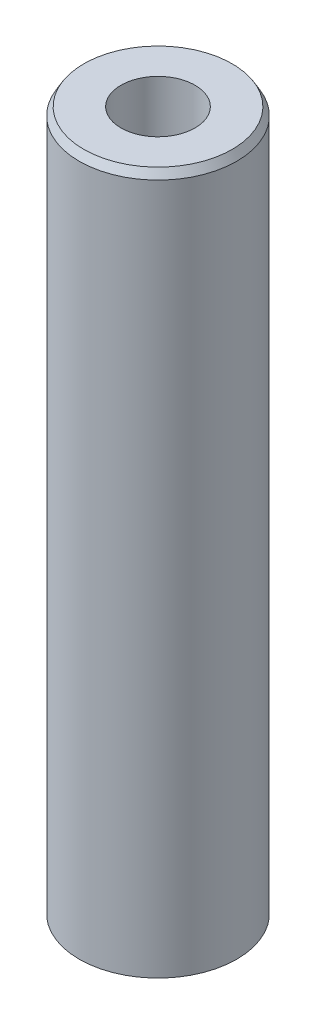
ISO-10303-21;
HEADER;
FILE_DESCRIPTION(('STEP AP214'),'2;1');
FILE_NAME('part.step','',(''),(''),'','','');
FILE_SCHEMA(('AUTOMOTIVE_DESIGN { 1 0 10303 214 1 1 1 1 }'));
ENDSEC;
DATA;
#1=APPLICATION_CONTEXT('core data for automotive mechanical design processes');
#2=APPLICATION_PROTOCOL_DEFINITION('international standard','automotive_design',2000,#1);
#3=PRODUCT_CONTEXT('',#1,'mechanical');
#4=PRODUCT('Part','Part','',(#3));
#5=PRODUCT_RELATED_PRODUCT_CATEGORY('part','',(#4));
#6=PRODUCT_DEFINITION_FORMATION('','',#4);
#7=PRODUCT_DEFINITION_CONTEXT('part definition',#1,'design');
#8=PRODUCT_DEFINITION('design','',#6,#7);
#9=PRODUCT_DEFINITION_SHAPE('','',#8);
#10=(LENGTH_UNIT() NAMED_UNIT(*) SI_UNIT(.MILLI.,.METRE.));
#11=(NAMED_UNIT(*) PLANE_ANGLE_UNIT() SI_UNIT($,.RADIAN.));
#12=(NAMED_UNIT(*) SI_UNIT($,.STERADIAN.) SOLID_ANGLE_UNIT());
#13=UNCERTAINTY_MEASURE_WITH_UNIT(LENGTH_MEASURE(1.E-05),#10,'distance_accuracy_value','');
#14=(GEOMETRIC_REPRESENTATION_CONTEXT(3) GLOBAL_UNCERTAINTY_ASSIGNED_CONTEXT((#13)) GLOBAL_UNIT_ASSIGNED_CONTEXT((#10,
#11,#12)) REPRESENTATION_CONTEXT('',''));
#15=CARTESIAN_POINT('',(0.,0.,0.));
#16=DIRECTION('',(0.,0.,1.));
#17=DIRECTION('',(1.,0.,0.));
#18=AXIS2_PLACEMENT_3D('',#15,#16,#17);
#19=CARTESIAN_POINT('',(0.,245.557551608312,0.));
#20=DIRECTION('',(0.,-1.,0.));
#21=DIRECTION('',(0.,0.,-1.));
#22=AXIS2_PLACEMENT_3D('',#19,#20,#21);
#23=CYLINDRICAL_SURFACE('',#22,27.5);
#24=CARTESIAN_POINT('',(0.,242.77321057051,0.));
#25=DIRECTION('',(0.,1.,0.));
#26=DIRECTION('',(0.,0.,1.));
#27=AXIS2_PLACEMENT_3D('',#24,#25,#26);
#28=CIRCLE('',#27,27.5);
#29=CARTESIAN_POINT('',(0.,242.77321057051,27.5));
#30=VERTEX_POINT('',#29);
#31=EDGE_CURVE('E50',#30,#30,#28,.F.);
#32=ORIENTED_EDGE('',*,*,#31,.T.);
#33=EDGE_LOOP('',(#32));
#34=FACE_BOUND('',#33,.T.);
#35=CARTESIAN_POINT('',(0.,1.6075400476907,0.));
#36=DIRECTION('',(0.,1.,0.));
#37=DIRECTION('',(0.,0.,1.));
#38=AXIS2_PLACEMENT_3D('',#35,#36,#37);
#39=CIRCLE('',#38,27.5);
#40=CARTESIAN_POINT('',(0.,1.6075400476907,27.5));
#41=VERTEX_POINT('',#40);
#42=EDGE_CURVE('E51',#41,#41,#39,.T.);
#43=ORIENTED_EDGE('',*,*,#42,.T.);
#44=EDGE_LOOP('',(#43));
#45=FACE_BOUND('',#44,.T.);
#46=ADVANCED_FACE('F39',(#34,#45),#23,.T.);
#47=CARTESIAN_POINT('',(0.,245.557551608312,0.));
#48=DIRECTION('',(0.,1.,0.));
#49=DIRECTION('',(0.,0.,1.));
#50=AXIS2_PLACEMENT_3D('',#47,#48,#49);
#51=PLANE('',#50);
#52=CARTESIAN_POINT('',(0.,245.557551608312,0.));
#53=DIRECTION('',(0.,1.,0.));
#54=DIRECTION('',(0.,0.,1.));
#55=AXIS2_PLACEMENT_3D('',#52,#53,#54);
#56=CIRCLE('',#55,25.8924599523093);
#57=CARTESIAN_POINT('',(0.,245.557551608312,25.8924599523093));
#58=VERTEX_POINT('',#57);
#59=EDGE_CURVE('E54',#58,#58,#56,.T.);
#60=ORIENTED_EDGE('',*,*,#59,.T.);
#61=EDGE_LOOP('',(#60));
#62=FACE_BOUND('',#61,.T.);
#63=CARTESIAN_POINT('',(0.,245.557551608312,0.));
#64=DIRECTION('',(0.,1.,0.));
#65=DIRECTION('',(0.,0.,1.));
#66=AXIS2_PLACEMENT_3D('',#63,#64,#65);
#67=CIRCLE('',#66,12.9272792613188);
#68=CARTESIAN_POINT('',(0.,245.557551608312,12.9272792613188));
#69=VERTEX_POINT('',#68);
#70=EDGE_CURVE('E58',#69,#69,#67,.T.);
#71=ORIENTED_EDGE('',*,*,#70,.F.);
#72=EDGE_LOOP('',(#71));
#73=FACE_BOUND('',#72,.T.);
#74=ADVANCED_FACE('F69',(#62,#73),#51,.T.);
#75=CARTESIAN_POINT('',(0.,0.,0.));
#76=DIRECTION('',(0.,1.,0.));
#77=DIRECTION('',(0.,0.,1.));
#78=AXIS2_PLACEMENT_3D('',#75,#76,#77);
#79=PLANE('',#78);
#80=CARTESIAN_POINT('',(0.,0.,0.));
#81=DIRECTION('',(0.,1.,0.));
#82=DIRECTION('',(0.,0.,1.));
#83=AXIS2_PLACEMENT_3D('',#80,#81,#82);
#84=CIRCLE('',#83,24.715658962198);
#85=CARTESIAN_POINT('',(0.,0.,24.715658962198));
#86=VERTEX_POINT('',#85);
#87=EDGE_CURVE('E10',#86,#86,#84,.F.);
#88=ORIENTED_EDGE('',*,*,#87,.T.);
#89=EDGE_LOOP('',(#88));
#90=FACE_BOUND('',#89,.T.);
#91=CARTESIAN_POINT('',(0.,0.,0.));
#92=DIRECTION('',(0.,1.,0.));
#93=DIRECTION('',(0.,0.,1.));
#94=AXIS2_PLACEMENT_3D('',#91,#92,#93);
#95=CIRCLE('',#94,12.9272792613188);
#96=CARTESIAN_POINT('',(0.,0.,12.9272792613188));
#97=VERTEX_POINT('',#96);
#98=EDGE_CURVE('E63',#97,#97,#95,.T.);
#99=ORIENTED_EDGE('',*,*,#98,.T.);
#100=EDGE_LOOP('',(#99));
#101=FACE_BOUND('',#100,.T.);
#102=ADVANCED_FACE('F75',(#90,#101),#79,.F.);
#103=CARTESIAN_POINT('',(0.,245.557551608312,0.));
#104=DIRECTION('',(0.,-1.,0.));
#105=DIRECTION('',(0.,0.,-1.));
#106=AXIS2_PLACEMENT_3D('',#103,#104,#105);
#107=CYLINDRICAL_SURFACE('',#106,12.9272792613188);
#108=ORIENTED_EDGE('',*,*,#70,.T.);
#109=EDGE_LOOP('',(#108));
#110=FACE_BOUND('',#109,.T.);
#111=ORIENTED_EDGE('',*,*,#98,.F.);
#112=EDGE_LOOP('',(#111));
#113=FACE_BOUND('',#112,.T.);
#114=ADVANCED_FACE('F70',(#110,#113),#107,.F.);
#115=CARTESIAN_POINT('',(0.,245.557551608312,0.));
#116=DIRECTION('',(0.,-1.,0.));
#117=DIRECTION('',(0.,0.,-1.));
#118=AXIS2_PLACEMENT_3D('',#115,#116,#117);
#119=CONICAL_SURFACE('',#118,25.8924599523093,0.523598775598294);
#120=ORIENTED_EDGE('',*,*,#31,.F.);
#121=EDGE_LOOP('',(#120));
#122=FACE_BOUND('',#121,.T.);
#123=ORIENTED_EDGE('',*,*,#59,.F.);
#124=EDGE_LOOP('',(#123));
#125=FACE_BOUND('',#124,.T.);
#126=ADVANCED_FACE('F81',(#122,#125),#119,.T.);
#127=CARTESIAN_POINT('',(0.,1.6075400476907,0.));
#128=DIRECTION('',(0.,1.,0.));
#129=DIRECTION('',(0.,0.,1.));
#130=AXIS2_PLACEMENT_3D('',#127,#128,#129);
#131=CONICAL_SURFACE('',#130,27.5,1.0471975511966);
#132=CARTESIAN_POINT('',(0.,0.,24.715658962198));
#133=CARTESIAN_POINT('',(0.,0.0167452088301113,24.7446625146751));
#134=CARTESIAN_POINT('',(0.,0.0334904176602228,24.7736660671522));
#135=CARTESIAN_POINT('',(0.,0.0669808353204457,24.8316731721064));
#136=CARTESIAN_POINT('',(0.,0.0837260441505572,24.8606767245835));
#137=CARTESIAN_POINT('',(0.,0.11721646181078,24.9186838295377));
#138=CARTESIAN_POINT('',(0.,0.133961670640892,24.9476873820148));
#139=CARTESIAN_POINT('',(0.,0.167452088301115,25.005694486969));
#140=CARTESIAN_POINT('',(0.,0.184197297131226,25.0346980394461));
#141=CARTESIAN_POINT('',(0.,0.217687714791449,25.0927051444003));
#142=CARTESIAN_POINT('',(0.,0.234432923621561,25.1217086968774));
#143=CARTESIAN_POINT('',(0.,0.267923341281784,25.1797158018317));
#144=CARTESIAN_POINT('',(0.,0.284668550111895,25.2087193543088));
#145=CARTESIAN_POINT('',(0.,0.318158967772118,25.266726459263));
#146=CARTESIAN_POINT('',(0.,0.33490417660223,25.2957300117401));
#147=CARTESIAN_POINT('',(0.,0.368394594262453,25.3537371166943));
#148=CARTESIAN_POINT('',(0.,0.385139803092564,25.3827406691714));
#149=CARTESIAN_POINT('',(0.,0.418630220752787,25.4407477741256));
#150=CARTESIAN_POINT('',(0.,0.435375429582898,25.4697513266027));
#151=CARTESIAN_POINT('',(0.,0.468865847243122,25.5277584315569));
#152=CARTESIAN_POINT('',(0.,0.485611056073233,25.556761984034));
#153=CARTESIAN_POINT('',(0.,0.519101473733456,25.6147690889882));
#154=CARTESIAN_POINT('',(0.,0.535846682563567,25.6437726414653));
#155=CARTESIAN_POINT('',(0.,0.56933710022379,25.7017797464195));
#156=CARTESIAN_POINT('',(0.,0.586082309053902,25.7307832988966));
#157=CARTESIAN_POINT('',(0.,0.619572726714125,25.7887904038508));
#158=CARTESIAN_POINT('',(0.,0.636317935544236,25.817793956328));
#159=CARTESIAN_POINT('',(0.,0.669808353204459,25.8758010612822));
#160=CARTESIAN_POINT('',(0.,0.686553562034571,25.9048046137593));
#161=CARTESIAN_POINT('',(0.,0.720043979694794,25.9628117187135));
#162=CARTESIAN_POINT('',(0.,0.736789188524905,25.9918152711906));
#163=CARTESIAN_POINT('',(0.,0.770279606185128,26.0498223761448));
#164=CARTESIAN_POINT('',(0.,0.78702481501524,26.0788259286219));
#165=CARTESIAN_POINT('',(0.,0.820515232675463,26.1368330335761));
#166=CARTESIAN_POINT('',(0.,0.837260441505574,26.1658365860532));
#167=CARTESIAN_POINT('',(0.,0.870750859165797,26.2238436910074));
#168=CARTESIAN_POINT('',(0.,0.887496067995909,26.2528472434845));
#169=CARTESIAN_POINT('',(0.,0.920986485656132,26.3108543484387));
#170=CARTESIAN_POINT('',(0.,0.937731694486243,26.3398579009158));
#171=CARTESIAN_POINT('',(0.,0.971222112146466,26.39786500587));
#172=CARTESIAN_POINT('',(0.,0.987967320976578,26.4268685583471));
#173=CARTESIAN_POINT('',(0.,1.0214577386368,26.4848756633014));
#174=CARTESIAN_POINT('',(0.,1.03820294746691,26.5138792157785));
#175=CARTESIAN_POINT('',(0.,1.07169336512714,26.5718863207327));
#176=CARTESIAN_POINT('',(0.,1.08843857395725,26.6008898732098));
#177=CARTESIAN_POINT('',(0.,1.12192899161747,26.658896978164));
#178=CARTESIAN_POINT('',(0.,1.13867420044758,26.6879005306411));
#179=CARTESIAN_POINT('',(0.,1.1721646181078,26.7459076355953));
#180=CARTESIAN_POINT('',(0.,1.18890982693792,26.7749111880724));
#181=CARTESIAN_POINT('',(0.,1.22240024459814,26.8329182930266));
#182=CARTESIAN_POINT('',(0.,1.23914545342825,26.8619218455037));
#183=CARTESIAN_POINT('',(0.,1.27263587108847,26.9199289504579));
#184=CARTESIAN_POINT('',(0.,1.28938107991858,26.948932502935));
#185=CARTESIAN_POINT('',(0.,1.32287149757881,27.0069396078892));
#186=CARTESIAN_POINT('',(0.,1.33961670640892,27.0359431603663));
#187=CARTESIAN_POINT('',(0.,1.37310712406914,27.0939502653205));
#188=CARTESIAN_POINT('',(0.,1.38985233289925,27.1229538177976));
#189=CARTESIAN_POINT('',(0.,1.42334275055948,27.1809609227519));
#190=CARTESIAN_POINT('',(0.,1.44008795938959,27.209964475229));
#191=CARTESIAN_POINT('',(0.,1.47357837704981,27.2679715801832));
#192=CARTESIAN_POINT('',(0.,1.49032358587992,27.2969751326603));
#193=CARTESIAN_POINT('',(0.,1.52381400354015,27.3549822376145));
#194=CARTESIAN_POINT('',(0.,1.54055921237026,27.3839857900916));
#195=CARTESIAN_POINT('',(0.,1.57404963003048,27.4419928950458));
#196=CARTESIAN_POINT('',(0.,1.59079483886059,27.4709964475229));
#197=CARTESIAN_POINT('',(0.,1.6075400476907,27.5));
#198=B_SPLINE_CURVE_WITH_KNOTS('',3,(#132,#133,#134,#135,#136,#137,#138,#139,#140,#141,#142,
#143,#144,#145,#146,#147,#148,#149,#150,#151,#152,#153,#154,#155,#156,#157,#158,#159,#160,#161,
#162,#163,#164,#165,#166,#167,#168,#169,#170,#171,#172,#173,#174,#175,#176,#177,#178,#179,#180,
#181,#182,#183,#184,#185,#186,#187,#188,#189,#190,#191,#192,#193,#194,#195,#196,#197),
.UNSPECIFIED.,.F.,.F.,(4,2,2,2,2,2,2,2,2,2,2,2,2,2,2,2,2,2,2,2,2,2,2,2,2,2,2,2,2,2,2,2,4),(0.,
0.100471252980669,0.200942505961339,0.301413758942008,0.401885011922677,0.502356264903347,
0.602827517884016,0.703298770864685,0.803770023845357,0.904241276826027,1.0047125298067,
1.10518378278737,1.20565503576803,1.3061262887487,1.40659754172937,1.50706879471004,
1.60754004769071,1.70801130067138,1.80848255365205,1.90895380663272,2.00942505961339,
2.10989631259406,2.21036756557473,2.3108388185554,2.41131007153607,2.51178132451674,
2.61225257749741,2.71272383047808,2.81319508345875,2.91366633643942,3.01413758942009,
3.11460884240076,3.21508009538143),.UNSPECIFIED.);
#199=EDGE_CURVE('BSEAM45',#86,#41,#198,.T.);
#200=ORIENTED_EDGE('',*,*,#87,.F.);
#201=ORIENTED_EDGE('',*,*,#42,.F.);
#202=ORIENTED_EDGE('',*,*,#199,.T.);
#203=ORIENTED_EDGE('',*,*,#199,.F.);
#204=EDGE_LOOP('',(#200,#202,#201,#203));
#205=FACE_BOUND('',#204,.T.);
#206=ADVANCED_FACE('F45',(#205),#131,.T.);
#207=CLOSED_SHELL('',(#46,#74,#102,#114,#126,#206));
#208=MANIFOLD_SOLID_BREP('B2',#207);
#209=ADVANCED_BREP_SHAPE_REPRESENTATION('',(#18,#208),#14);
#210=SHAPE_DEFINITION_REPRESENTATION(#9,#209);
ENDSEC;
END-ISO-10303-21;
